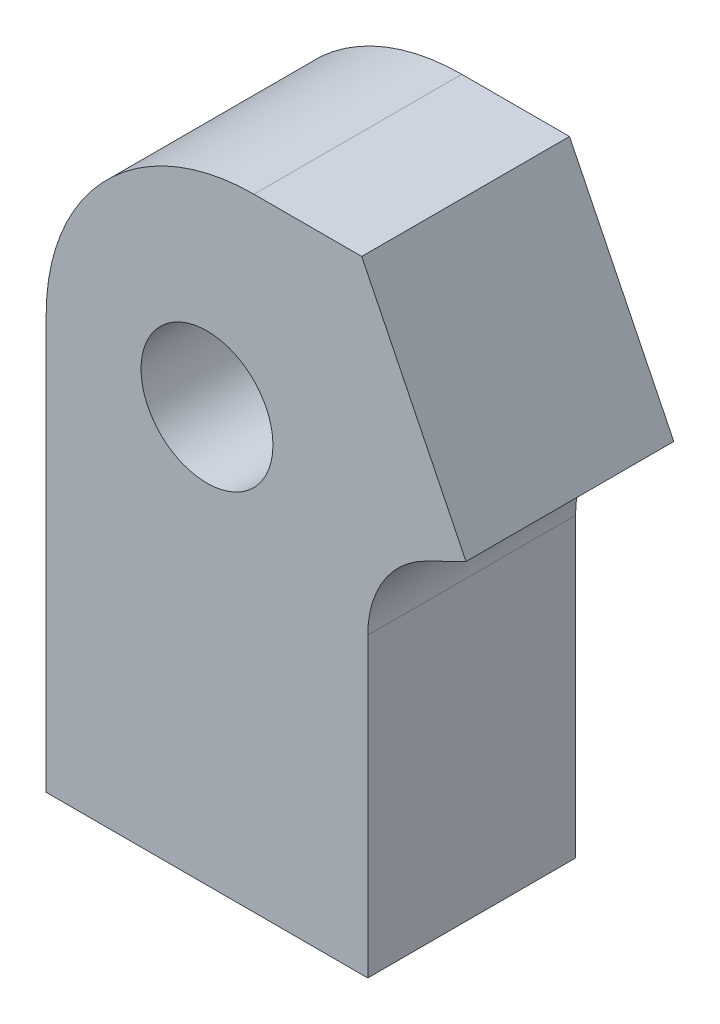
ISO-10303-21;
HEADER;
FILE_DESCRIPTION(('STEP AP214'),'2;1');
FILE_NAME('part.step','',(''),(''),'','','');
FILE_SCHEMA(('AUTOMOTIVE_DESIGN { 1 0 10303 214 1 1 1 1 }'));
ENDSEC;
DATA;
#1=APPLICATION_CONTEXT('core data for automotive mechanical design processes');
#2=APPLICATION_PROTOCOL_DEFINITION('international standard','automotive_design',2000,#1);
#3=PRODUCT_CONTEXT('',#1,'mechanical');
#4=PRODUCT('Part','Part','',(#3));
#5=PRODUCT_RELATED_PRODUCT_CATEGORY('part','',(#4));
#6=PRODUCT_DEFINITION_FORMATION('','',#4);
#7=PRODUCT_DEFINITION_CONTEXT('part definition',#1,'design');
#8=PRODUCT_DEFINITION('design','',#6,#7);
#9=PRODUCT_DEFINITION_SHAPE('','',#8);
#10=(LENGTH_UNIT() NAMED_UNIT(*) SI_UNIT(.MILLI.,.METRE.));
#11=(NAMED_UNIT(*) PLANE_ANGLE_UNIT() SI_UNIT($,.RADIAN.));
#12=(NAMED_UNIT(*) SI_UNIT($,.STERADIAN.) SOLID_ANGLE_UNIT());
#13=UNCERTAINTY_MEASURE_WITH_UNIT(LENGTH_MEASURE(1.E-05),#10,'distance_accuracy_value','');
#14=(GEOMETRIC_REPRESENTATION_CONTEXT(3) GLOBAL_UNCERTAINTY_ASSIGNED_CONTEXT((#13)) GLOBAL_UNIT_ASSIGNED_CONTEXT((#10,
#11,#12)) REPRESENTATION_CONTEXT('',''));
#15=CARTESIAN_POINT('',(0.,0.,0.));
#16=DIRECTION('',(0.,0.,1.));
#17=DIRECTION('',(1.,0.,0.));
#18=AXIS2_PLACEMENT_3D('',#15,#16,#17);
#19=CARTESIAN_POINT('',(-37.4644494800969,19.93,10.));
#20=DIRECTION('',(0.,0.,1.));
#21=DIRECTION('',(1.,0.,0.));
#22=AXIS2_PLACEMENT_3D('',#19,#20,#21);
#23=PLANE('',#22);
#24=DIRECTION('',(1.,0.,0.));
#25=VECTOR('',#24,1.);
#26=CARTESIAN_POINT('',(-31.9883133862717,0.,10.));
#27=LINE('',#26,#25);
#28=CARTESIAN_POINT('',(-47.4644494800969,0.,10.));
#29=VERTEX_POINT('',#28);
#30=CARTESIAN_POINT('',(-31.9883133862717,0.,10.));
#31=VERTEX_POINT('',#30);
#32=EDGE_CURVE('E145',#29,#31,#27,.T.);
#33=ORIENTED_EDGE('',*,*,#32,.T.);
#34=DIRECTION('',(0.,1.,0.));
#35=VECTOR('',#34,1.);
#36=CARTESIAN_POINT('',(-31.9883133862717,0.,10.));
#37=LINE('',#36,#35);
#38=CARTESIAN_POINT('',(-31.9883133862717,14.2873086681621,10.));
#39=VERTEX_POINT('',#38);
#40=EDGE_CURVE('E92',#31,#39,#37,.T.);
#41=ORIENTED_EDGE('',*,*,#40,.T.);
#42=CARTESIAN_POINT('',(-26.9883133862717,14.2873086681621,10.));
#43=DIRECTION('',(0.,0.,-1.));
#44=DIRECTION('',(-1.,0.,0.));
#45=AXIS2_PLACEMENT_3D('',#42,#43,#44);
#46=CIRCLE('',#45,5.);
#47=CARTESIAN_POINT('',(-29.1952892574421,18.7738727771515,10.));
#48=VERTEX_POINT('',#47);
#49=EDGE_CURVE('E160',#39,#48,#46,.T.);
#50=ORIENTED_EDGE('',*,*,#49,.T.);
#51=DIRECTION('',(0.897312821797879,0.441395174234073,0.));
#52=VECTOR('',#51,1.);
#53=CARTESIAN_POINT('',(-29.1952892574421,18.7738727771515,10.));
#54=LINE('',#53,#52);
#55=CARTESIAN_POINT('',(-27.2594005462744,19.7261515301192,10.));
#56=VERTEX_POINT('',#55);
#57=EDGE_CURVE('E172',#48,#56,#54,.T.);
#58=ORIENTED_EDGE('',*,*,#57,.T.);
#59=DIRECTION('',(-0.441395174234069,0.897312821797881,0.));
#60=VECTOR('',#59,1.);
#61=CARTESIAN_POINT('',(-29.7690768619415,24.8280757650596,10.));
#62=LINE('',#61,#60);
#63=CARTESIAN_POINT('',(-32.2787531776085,29.93,10.));
#64=VERTEX_POINT('',#63);
#65=EDGE_CURVE('E111',#56,#64,#62,.T.);
#66=ORIENTED_EDGE('',*,*,#65,.T.);
#67=DIRECTION('',(-1.,0.,0.));
#68=VECTOR('',#67,1.);
#69=CARTESIAN_POINT('',(-37.4644494800969,29.93,10.));
#70=LINE('',#69,#68);
#71=CARTESIAN_POINT('',(-37.4644494800969,29.93,10.));
#72=VERTEX_POINT('',#71);
#73=EDGE_CURVE('E105',#64,#72,#70,.T.);
#74=ORIENTED_EDGE('',*,*,#73,.T.);
#75=CARTESIAN_POINT('',(-37.4644494800969,19.93,10.));
#76=DIRECTION('',(0.,0.,1.));
#77=DIRECTION('',(1.,0.,0.));
#78=AXIS2_PLACEMENT_3D('',#75,#76,#77);
#79=CIRCLE('',#78,10.);
#80=CARTESIAN_POINT('',(-47.4644494800969,19.93,10.));
#81=VERTEX_POINT('',#80);
#82=EDGE_CURVE('E109',#72,#81,#79,.T.);
#83=ORIENTED_EDGE('',*,*,#82,.T.);
#84=DIRECTION('',(0.,-1.,0.));
#85=VECTOR('',#84,1.);
#86=CARTESIAN_POINT('',(-47.4644494800969,0.,10.));
#87=LINE('',#86,#85);
#88=EDGE_CURVE('E49',#81,#29,#87,.T.);
#89=ORIENTED_EDGE('',*,*,#88,.T.);
#90=EDGE_LOOP('',(#33,#41,#50,#58,#66,#74,#83,#89));
#91=FACE_BOUND('',#90,.T.);
#92=CARTESIAN_POINT('',(-39.7263814331843,19.93,10.));
#93=DIRECTION('',(0.,0.,1.));
#94=DIRECTION('',(1.,0.,0.));
#95=AXIS2_PLACEMENT_3D('',#92,#93,#94);
#96=CIRCLE('',#95,3.175);
#97=CARTESIAN_POINT('',(-36.5513814331843,19.93,10.));
#98=VERTEX_POINT('',#97);
#99=EDGE_CURVE('E133',#98,#98,#96,.T.);
#100=ORIENTED_EDGE('',*,*,#99,.F.);
#101=EDGE_LOOP('',(#100));
#102=FACE_BOUND('',#101,.T.);
#103=ADVANCED_FACE('F32',(#91,#102),#23,.T.);
#104=CARTESIAN_POINT('',(-37.4644494800969,19.93,0.));
#105=DIRECTION('',(0.,0.,1.));
#106=DIRECTION('',(1.,0.,0.));
#107=AXIS2_PLACEMENT_3D('',#104,#105,#106);
#108=PLANE('',#107);
#109=DIRECTION('',(1.,0.,0.));
#110=VECTOR('',#109,1.);
#111=CARTESIAN_POINT('',(-31.9883133862717,0.,0.));
#112=LINE('',#111,#110);
#113=CARTESIAN_POINT('',(-47.4644494800969,0.,0.));
#114=VERTEX_POINT('',#113);
#115=CARTESIAN_POINT('',(-31.9883133862717,0.,0.));
#116=VERTEX_POINT('',#115);
#117=EDGE_CURVE('E129',#114,#116,#112,.T.);
#118=ORIENTED_EDGE('',*,*,#117,.F.);
#119=DIRECTION('',(0.,-1.,0.));
#120=VECTOR('',#119,1.);
#121=CARTESIAN_POINT('',(-47.4644494800969,0.,0.));
#122=LINE('',#121,#120);
#123=CARTESIAN_POINT('',(-47.4644494800969,19.93,0.));
#124=VERTEX_POINT('',#123);
#125=EDGE_CURVE('E84',#124,#114,#122,.T.);
#126=ORIENTED_EDGE('',*,*,#125,.F.);
#127=CARTESIAN_POINT('',(-37.4644494800969,19.93,0.));
#128=DIRECTION('',(0.,0.,1.));
#129=DIRECTION('',(1.,0.,0.));
#130=AXIS2_PLACEMENT_3D('',#127,#128,#129);
#131=CIRCLE('',#130,10.);
#132=CARTESIAN_POINT('',(-37.4644494800969,29.93,0.));
#133=VERTEX_POINT('',#132);
#134=EDGE_CURVE('E78',#133,#124,#131,.T.);
#135=ORIENTED_EDGE('',*,*,#134,.F.);
#136=DIRECTION('',(-1.,0.,0.));
#137=VECTOR('',#136,1.);
#138=CARTESIAN_POINT('',(-37.4644494800969,29.93,0.));
#139=LINE('',#138,#137);
#140=CARTESIAN_POINT('',(-32.2787531776085,29.93,0.));
#141=VERTEX_POINT('',#140);
#142=EDGE_CURVE('E119',#141,#133,#139,.T.);
#143=ORIENTED_EDGE('',*,*,#142,.F.);
#144=DIRECTION('',(-0.441395174234069,0.897312821797881,0.));
#145=VECTOR('',#144,1.);
#146=CARTESIAN_POINT('',(-32.2787531776085,29.93,0.));
#147=LINE('',#146,#145);
#148=CARTESIAN_POINT('',(-27.2594005462744,19.7261515301192,0.));
#149=VERTEX_POINT('',#148);
#150=EDGE_CURVE('E140',#149,#141,#147,.T.);
#151=ORIENTED_EDGE('',*,*,#150,.F.);
#152=DIRECTION('',(0.897312821797879,0.441395174234073,0.));
#153=VECTOR('',#152,1.);
#154=CARTESIAN_POINT('',(-29.1952892574421,18.7738727771515,0.));
#155=LINE('',#154,#153);
#156=CARTESIAN_POINT('',(-29.1952892574421,18.7738727771515,0.));
#157=VERTEX_POINT('',#156);
#158=EDGE_CURVE('E137',#157,#149,#155,.T.);
#159=ORIENTED_EDGE('',*,*,#158,.F.);
#160=CARTESIAN_POINT('',(-26.9883133862717,14.2873086681621,0.));
#161=DIRECTION('',(0.,0.,-1.));
#162=DIRECTION('',(-1.,0.,0.));
#163=AXIS2_PLACEMENT_3D('',#160,#161,#162);
#164=CIRCLE('',#163,5.);
#165=CARTESIAN_POINT('',(-31.9883133862717,14.2873086681621,0.));
#166=VERTEX_POINT('',#165);
#167=EDGE_CURVE('E135',#166,#157,#164,.T.);
#168=ORIENTED_EDGE('',*,*,#167,.F.);
#169=DIRECTION('',(0.,1.,0.));
#170=VECTOR('',#169,1.);
#171=CARTESIAN_POINT('',(-31.9883133862717,0.,0.));
#172=LINE('',#171,#170);
#173=EDGE_CURVE('E132',#116,#166,#172,.T.);
#174=ORIENTED_EDGE('',*,*,#173,.F.);
#175=EDGE_LOOP('',(#118,#126,#135,#143,#151,#159,#168,#174));
#176=FACE_BOUND('',#175,.T.);
#177=CARTESIAN_POINT('',(-39.7263814331843,19.93,0.));
#178=DIRECTION('',(0.,0.,1.));
#179=DIRECTION('',(1.,0.,0.));
#180=AXIS2_PLACEMENT_3D('',#177,#178,#179);
#181=CIRCLE('',#180,3.175);
#182=CARTESIAN_POINT('',(-36.5513814331843,19.93,0.));
#183=VERTEX_POINT('',#182);
#184=EDGE_CURVE('E178',#183,#183,#181,.T.);
#185=ORIENTED_EDGE('',*,*,#184,.T.);
#186=EDGE_LOOP('',(#185));
#187=FACE_BOUND('',#186,.T.);
#188=ADVANCED_FACE('F164',(#176,#187),#108,.F.);
#189=CARTESIAN_POINT('',(-31.9883133862717,0.,10.));
#190=DIRECTION('',(0.,1.,0.));
#191=DIRECTION('',(-1.,0.,0.));
#192=AXIS2_PLACEMENT_3D('',#189,#190,#191);
#193=PLANE('',#192);
#194=ORIENTED_EDGE('',*,*,#117,.T.);
#195=DIRECTION('',(0.,0.,-1.));
#196=VECTOR('',#195,1.);
#197=CARTESIAN_POINT('',(-31.9883133862717,0.,10.));
#198=LINE('',#197,#196);
#199=EDGE_CURVE('E11',#31,#116,#198,.T.);
#200=ORIENTED_EDGE('',*,*,#199,.F.);
#201=ORIENTED_EDGE('',*,*,#32,.F.);
#202=DIRECTION('',(0.,0.,-1.));
#203=VECTOR('',#202,1.);
#204=CARTESIAN_POINT('',(-47.4644494800969,0.,10.));
#205=LINE('',#204,#203);
#206=EDGE_CURVE('E125',#29,#114,#205,.T.);
#207=ORIENTED_EDGE('',*,*,#206,.T.);
#208=EDGE_LOOP('',(#194,#200,#201,#207));
#209=FACE_BOUND('',#208,.T.);
#210=ADVANCED_FACE('F34',(#209),#193,.F.);
#211=CARTESIAN_POINT('',(-31.9883133862717,0.,10.));
#212=DIRECTION('',(-1.,0.,0.));
#213=DIRECTION('',(0.,-1.,0.));
#214=AXIS2_PLACEMENT_3D('',#211,#212,#213);
#215=PLANE('',#214);
#216=ORIENTED_EDGE('',*,*,#173,.T.);
#217=DIRECTION('',(0.,0.,-1.));
#218=VECTOR('',#217,1.);
#219=CARTESIAN_POINT('',(-31.9883133862717,14.2873086681621,10.));
#220=LINE('',#219,#218);
#221=EDGE_CURVE('E41',#39,#166,#220,.T.);
#222=ORIENTED_EDGE('',*,*,#221,.F.);
#223=ORIENTED_EDGE('',*,*,#40,.F.);
#224=ORIENTED_EDGE('',*,*,#199,.T.);
#225=EDGE_LOOP('',(#216,#222,#223,#224));
#226=FACE_BOUND('',#225,.T.);
#227=ADVANCED_FACE('F206',(#226),#215,.F.);
#228=CARTESIAN_POINT('',(-26.9883133862717,14.2873086681621,10.));
#229=DIRECTION('',(0.,0.,-1.));
#230=DIRECTION('',(-1.,0.,0.));
#231=AXIS2_PLACEMENT_3D('',#228,#229,#230);
#232=CYLINDRICAL_SURFACE('',#231,5.);
#233=ORIENTED_EDGE('',*,*,#167,.T.);
#234=DIRECTION('',(0.,0.,-1.));
#235=VECTOR('',#234,1.);
#236=CARTESIAN_POINT('',(-29.1952892574421,18.7738727771515,10.));
#237=LINE('',#236,#235);
#238=EDGE_CURVE('E152',#48,#157,#237,.T.);
#239=ORIENTED_EDGE('',*,*,#238,.F.);
#240=ORIENTED_EDGE('',*,*,#49,.F.);
#241=ORIENTED_EDGE('',*,*,#221,.T.);
#242=EDGE_LOOP('',(#233,#239,#240,#241));
#243=FACE_BOUND('',#242,.T.);
#244=ADVANCED_FACE('F158',(#243),#232,.F.);
#245=CARTESIAN_POINT('',(-29.1952892574421,18.7738727771515,10.));
#246=DIRECTION('',(-0.441395174234073,0.897312821797879,0.));
#247=DIRECTION('',(-0.897312821797879,-0.441395174234073,0.));
#248=AXIS2_PLACEMENT_3D('',#245,#246,#247);
#249=PLANE('',#248);
#250=ORIENTED_EDGE('',*,*,#158,.T.);
#251=DIRECTION('',(0.,0.,-1.));
#252=VECTOR('',#251,1.);
#253=CARTESIAN_POINT('',(-27.2594005462744,19.7261515301192,10.));
#254=LINE('',#253,#252);
#255=EDGE_CURVE('E149',#56,#149,#254,.T.);
#256=ORIENTED_EDGE('',*,*,#255,.F.);
#257=ORIENTED_EDGE('',*,*,#57,.F.);
#258=ORIENTED_EDGE('',*,*,#238,.T.);
#259=EDGE_LOOP('',(#250,#256,#257,#258));
#260=FACE_BOUND('',#259,.T.);
#261=ADVANCED_FACE('F168',(#260),#249,.F.);
#262=CARTESIAN_POINT('',(-32.2787531776085,29.93,10.));
#263=DIRECTION('',(-0.897312821797881,-0.441395174234069,0.));
#264=DIRECTION('',(0.441395174234069,-0.897312821797881,0.));
#265=AXIS2_PLACEMENT_3D('',#262,#263,#264);
#266=PLANE('',#265);
#267=ORIENTED_EDGE('',*,*,#150,.T.);
#268=DIRECTION('',(0.,0.,-1.));
#269=VECTOR('',#268,1.);
#270=CARTESIAN_POINT('',(-32.2787531776085,29.93,10.));
#271=LINE('',#270,#269);
#272=EDGE_CURVE('E120',#64,#141,#271,.T.);
#273=ORIENTED_EDGE('',*,*,#272,.F.);
#274=ORIENTED_EDGE('',*,*,#65,.F.);
#275=ORIENTED_EDGE('',*,*,#255,.T.);
#276=EDGE_LOOP('',(#267,#273,#274,#275));
#277=FACE_BOUND('',#276,.T.);
#278=ADVANCED_FACE('F171',(#277),#266,.F.);
#279=CARTESIAN_POINT('',(-37.4644494800969,29.93,10.));
#280=DIRECTION('',(0.,-1.,0.));
#281=DIRECTION('',(0.,0.,-1.));
#282=AXIS2_PLACEMENT_3D('',#279,#280,#281);
#283=PLANE('',#282);
#284=ORIENTED_EDGE('',*,*,#142,.T.);
#285=DIRECTION('',(0.,0.,-1.));
#286=VECTOR('',#285,1.);
#287=CARTESIAN_POINT('',(-37.4644494800969,29.93,10.));
#288=LINE('',#287,#286);
#289=EDGE_CURVE('E116',#72,#133,#288,.T.);
#290=ORIENTED_EDGE('',*,*,#289,.F.);
#291=ORIENTED_EDGE('',*,*,#73,.F.);
#292=ORIENTED_EDGE('',*,*,#272,.T.);
#293=EDGE_LOOP('',(#284,#290,#291,#292));
#294=FACE_BOUND('',#293,.T.);
#295=ADVANCED_FACE('F117',(#294),#283,.F.);
#296=CARTESIAN_POINT('',(-37.4644494800969,19.93,10.));
#297=DIRECTION('',(0.,0.,-1.));
#298=DIRECTION('',(-1.,0.,0.));
#299=AXIS2_PLACEMENT_3D('',#296,#297,#298);
#300=CYLINDRICAL_SURFACE('',#299,10.);
#301=ORIENTED_EDGE('',*,*,#134,.T.);
#302=DIRECTION('',(0.,0.,-1.));
#303=VECTOR('',#302,1.);
#304=CARTESIAN_POINT('',(-47.4644494800969,19.93,10.));
#305=LINE('',#304,#303);
#306=EDGE_CURVE('E121',#81,#124,#305,.T.);
#307=ORIENTED_EDGE('',*,*,#306,.F.);
#308=ORIENTED_EDGE('',*,*,#82,.F.);
#309=ORIENTED_EDGE('',*,*,#289,.T.);
#310=EDGE_LOOP('',(#301,#307,#308,#309));
#311=FACE_BOUND('',#310,.T.);
#312=ADVANCED_FACE('F123',(#311),#300,.T.);
#313=CARTESIAN_POINT('',(-47.4644494800969,0.,10.));
#314=DIRECTION('',(1.,0.,0.));
#315=DIRECTION('',(0.,0.,-1.));
#316=AXIS2_PLACEMENT_3D('',#313,#314,#315);
#317=PLANE('',#316);
#318=ORIENTED_EDGE('',*,*,#125,.T.);
#319=ORIENTED_EDGE('',*,*,#206,.F.);
#320=ORIENTED_EDGE('',*,*,#88,.F.);
#321=ORIENTED_EDGE('',*,*,#306,.T.);
#322=EDGE_LOOP('',(#318,#319,#320,#321));
#323=FACE_BOUND('',#322,.T.);
#324=ADVANCED_FACE('F194',(#323),#317,.F.);
#325=CARTESIAN_POINT('',(-39.7263814331843,19.93,10.));
#326=DIRECTION('',(0.,0.,-1.));
#327=DIRECTION('',(-1.,0.,0.));
#328=AXIS2_PLACEMENT_3D('',#325,#326,#327);
#329=CYLINDRICAL_SURFACE('',#328,3.175);
#330=ORIENTED_EDGE('',*,*,#99,.T.);
#331=EDGE_LOOP('',(#330));
#332=FACE_BOUND('',#331,.T.);
#333=ORIENTED_EDGE('',*,*,#184,.F.);
#334=EDGE_LOOP('',(#333));
#335=FACE_BOUND('',#334,.T.);
#336=ADVANCED_FACE('F184',(#332,#335),#329,.F.);
#337=CLOSED_SHELL('',(#103,#188,#210,#227,#244,#261,#278,#295,#312,#324,#336));
#338=MANIFOLD_SOLID_BREP('B2',#337);
#339=ADVANCED_BREP_SHAPE_REPRESENTATION('',(#18,#338),#14);
#340=SHAPE_DEFINITION_REPRESENTATION(#9,#339);
ENDSEC;
END-ISO-10303-21;
